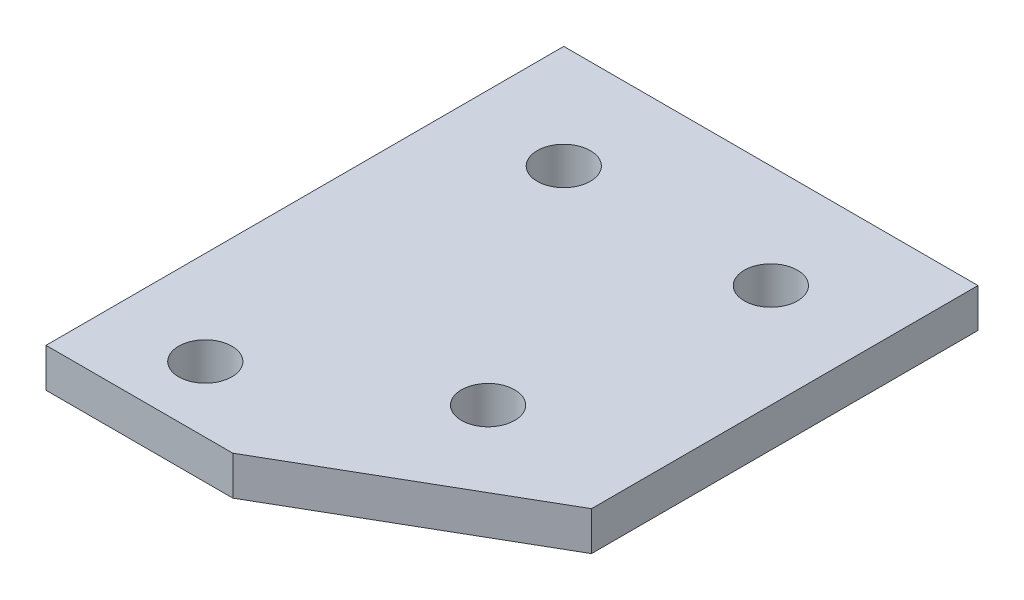
ISO-10303-21;
HEADER;
FILE_DESCRIPTION(('STEP AP214'),'2;1');
FILE_NAME('part.step','',(''),(''),'','','');
FILE_SCHEMA(('AUTOMOTIVE_DESIGN { 1 0 10303 214 1 1 1 1 }'));
ENDSEC;
DATA;
#1=APPLICATION_CONTEXT('core data for automotive mechanical design processes');
#2=APPLICATION_PROTOCOL_DEFINITION('international standard','automotive_design',2000,#1);
#3=PRODUCT_CONTEXT('',#1,'mechanical');
#4=PRODUCT('Part','Part','',(#3));
#5=PRODUCT_RELATED_PRODUCT_CATEGORY('part','',(#4));
#6=PRODUCT_DEFINITION_FORMATION('','',#4);
#7=PRODUCT_DEFINITION_CONTEXT('part definition',#1,'design');
#8=PRODUCT_DEFINITION('design','',#6,#7);
#9=PRODUCT_DEFINITION_SHAPE('','',#8);
#10=(LENGTH_UNIT() NAMED_UNIT(*) SI_UNIT(.MILLI.,.METRE.));
#11=(NAMED_UNIT(*) PLANE_ANGLE_UNIT() SI_UNIT($,.RADIAN.));
#12=(NAMED_UNIT(*) SI_UNIT($,.STERADIAN.) SOLID_ANGLE_UNIT());
#13=UNCERTAINTY_MEASURE_WITH_UNIT(LENGTH_MEASURE(1.E-05),#10,'distance_accuracy_value','');
#14=(GEOMETRIC_REPRESENTATION_CONTEXT(3) GLOBAL_UNCERTAINTY_ASSIGNED_CONTEXT((#13)) GLOBAL_UNIT_ASSIGNED_CONTEXT((#10,
#11,#12)) REPRESENTATION_CONTEXT('',''));
#15=CARTESIAN_POINT('',(0.,0.,0.));
#16=DIRECTION('',(0.,0.,1.));
#17=DIRECTION('',(1.,0.,0.));
#18=AXIS2_PLACEMENT_3D('',#15,#16,#17);
#19=CARTESIAN_POINT('',(22.9077466152338,-4.7752,63.5));
#20=DIRECTION('',(0.499999999999999,0.,0.866025403784439));
#21=DIRECTION('',(0.866025403784439,0.,-0.5));
#22=AXIS2_PLACEMENT_3D('',#19,#20,#21);
#23=PLANE('',#22);
#24=DIRECTION('',(0.866025403784439,0.,-0.5));
#25=VECTOR('',#24,1.);
#26=CARTESIAN_POINT('',(22.9077466152338,0.,63.5));
#27=LINE('',#26,#25);
#28=CARTESIAN_POINT('',(22.9077466152338,0.,63.5));
#29=VERTEX_POINT('',#28);
#30=CARTESIAN_POINT('',(50.8,0.,47.3964));
#31=VERTEX_POINT('',#30);
#32=EDGE_CURVE('E109',#29,#31,#27,.T.);
#33=ORIENTED_EDGE('',*,*,#32,.F.);
#34=DIRECTION('',(0.,1.,0.));
#35=VECTOR('',#34,1.);
#36=CARTESIAN_POINT('',(22.9077466152338,-4.7752,63.5));
#37=LINE('',#36,#35);
#38=CARTESIAN_POINT('',(22.9077466152338,-4.7752,63.5));
#39=VERTEX_POINT('',#38);
#40=EDGE_CURVE('E11',#39,#29,#37,.T.);
#41=ORIENTED_EDGE('',*,*,#40,.F.);
#42=DIRECTION('',(0.866025403784439,0.,-0.5));
#43=VECTOR('',#42,1.);
#44=CARTESIAN_POINT('',(22.9077466152338,-4.7752,63.5));
#45=LINE('',#44,#43);
#46=CARTESIAN_POINT('',(50.8,-4.7752,47.3964));
#47=VERTEX_POINT('',#46);
#48=EDGE_CURVE('E104',#39,#47,#45,.T.);
#49=ORIENTED_EDGE('',*,*,#48,.T.);
#50=DIRECTION('',(0.,1.,0.));
#51=VECTOR('',#50,1.);
#52=CARTESIAN_POINT('',(50.8,-4.7752,47.3964));
#53=LINE('',#52,#51);
#54=EDGE_CURVE('E35',#47,#31,#53,.T.);
#55=ORIENTED_EDGE('',*,*,#54,.T.);
#56=EDGE_LOOP('',(#33,#41,#49,#55));
#57=FACE_BOUND('',#56,.T.);
#58=ADVANCED_FACE('F32',(#57),#23,.T.);
#59=CARTESIAN_POINT('',(0.,-4.7752,63.5));
#60=DIRECTION('',(0.,0.,1.));
#61=DIRECTION('',(1.,0.,0.));
#62=AXIS2_PLACEMENT_3D('',#59,#60,#61);
#63=PLANE('',#62);
#64=DIRECTION('',(1.,0.,0.));
#65=VECTOR('',#64,1.);
#66=CARTESIAN_POINT('',(0.,0.,63.5));
#67=LINE('',#66,#65);
#68=CARTESIAN_POINT('',(0.,0.,63.5));
#69=VERTEX_POINT('',#68);
#70=EDGE_CURVE('E119',#69,#29,#67,.T.);
#71=ORIENTED_EDGE('',*,*,#70,.F.);
#72=DIRECTION('',(0.,1.,0.));
#73=VECTOR('',#72,1.);
#74=CARTESIAN_POINT('',(0.,-4.7752,63.5));
#75=LINE('',#74,#73);
#76=CARTESIAN_POINT('',(0.,-4.7752,63.5));
#77=VERTEX_POINT('',#76);
#78=EDGE_CURVE('E41',#77,#69,#75,.T.);
#79=ORIENTED_EDGE('',*,*,#78,.F.);
#80=DIRECTION('',(1.,0.,0.));
#81=VECTOR('',#80,1.);
#82=CARTESIAN_POINT('',(0.,-4.7752,63.5));
#83=LINE('',#82,#81);
#84=EDGE_CURVE('E99',#77,#39,#83,.T.);
#85=ORIENTED_EDGE('',*,*,#84,.T.);
#86=ORIENTED_EDGE('',*,*,#40,.T.);
#87=EDGE_LOOP('',(#71,#79,#85,#86));
#88=FACE_BOUND('',#87,.T.);
#89=ADVANCED_FACE('F125',(#88),#63,.T.);
#90=CARTESIAN_POINT('',(0.,-4.7752,0.));
#91=DIRECTION('',(-1.,0.,0.));
#92=DIRECTION('',(0.,0.,1.));
#93=AXIS2_PLACEMENT_3D('',#90,#91,#92);
#94=PLANE('',#93);
#95=DIRECTION('',(0.,0.,1.));
#96=VECTOR('',#95,1.);
#97=CARTESIAN_POINT('',(0.,0.,0.));
#98=LINE('',#97,#96);
#99=CARTESIAN_POINT('',(0.,0.,0.));
#100=VERTEX_POINT('',#99);
#101=EDGE_CURVE('E88',#100,#69,#98,.T.);
#102=ORIENTED_EDGE('',*,*,#101,.F.);
#103=DIRECTION('',(0.,1.,0.));
#104=VECTOR('',#103,1.);
#105=CARTESIAN_POINT('',(0.,-4.7752,0.));
#106=LINE('',#105,#104);
#107=CARTESIAN_POINT('',(0.,-4.7752,0.));
#108=VERTEX_POINT('',#107);
#109=EDGE_CURVE('E83',#108,#100,#106,.T.);
#110=ORIENTED_EDGE('',*,*,#109,.F.);
#111=DIRECTION('',(0.,0.,1.));
#112=VECTOR('',#111,1.);
#113=CARTESIAN_POINT('',(0.,-4.7752,0.));
#114=LINE('',#113,#112);
#115=EDGE_CURVE('E86',#108,#77,#114,.T.);
#116=ORIENTED_EDGE('',*,*,#115,.T.);
#117=ORIENTED_EDGE('',*,*,#78,.T.);
#118=EDGE_LOOP('',(#102,#110,#116,#117));
#119=FACE_BOUND('',#118,.T.);
#120=ADVANCED_FACE('F85',(#119),#94,.T.);
#121=CARTESIAN_POINT('',(50.8,-4.7752,0.));
#122=DIRECTION('',(0.,0.,-1.));
#123=DIRECTION('',(-1.,0.,0.));
#124=AXIS2_PLACEMENT_3D('',#121,#122,#123);
#125=PLANE('',#124);
#126=DIRECTION('',(-1.,0.,0.));
#127=VECTOR('',#126,1.);
#128=CARTESIAN_POINT('',(50.8,0.,0.));
#129=LINE('',#128,#127);
#130=CARTESIAN_POINT('',(50.8,0.,0.));
#131=VERTEX_POINT('',#130);
#132=EDGE_CURVE('E116',#131,#100,#129,.T.);
#133=ORIENTED_EDGE('',*,*,#132,.F.);
#134=DIRECTION('',(0.,1.,0.));
#135=VECTOR('',#134,1.);
#136=CARTESIAN_POINT('',(50.8,-4.7752,0.));
#137=LINE('',#136,#135);
#138=CARTESIAN_POINT('',(50.8,-4.7752,0.));
#139=VERTEX_POINT('',#138);
#140=EDGE_CURVE('E93',#139,#131,#137,.T.);
#141=ORIENTED_EDGE('',*,*,#140,.F.);
#142=DIRECTION('',(-1.,0.,0.));
#143=VECTOR('',#142,1.);
#144=CARTESIAN_POINT('',(50.8,-4.7752,0.));
#145=LINE('',#144,#143);
#146=EDGE_CURVE('E98',#139,#108,#145,.T.);
#147=ORIENTED_EDGE('',*,*,#146,.T.);
#148=ORIENTED_EDGE('',*,*,#109,.T.);
#149=EDGE_LOOP('',(#133,#141,#147,#148));
#150=FACE_BOUND('',#149,.T.);
#151=ADVANCED_FACE('F101',(#150),#125,.T.);
#152=CARTESIAN_POINT('',(50.8,-4.7752,47.3964));
#153=DIRECTION('',(1.,0.,0.));
#154=DIRECTION('',(0.,0.,-1.));
#155=AXIS2_PLACEMENT_3D('',#152,#153,#154);
#156=PLANE('',#155);
#157=DIRECTION('',(0.,0.,-1.));
#158=VECTOR('',#157,1.);
#159=CARTESIAN_POINT('',(50.8,0.,47.3964));
#160=LINE('',#159,#158);
#161=EDGE_CURVE('E112',#31,#131,#160,.T.);
#162=ORIENTED_EDGE('',*,*,#161,.F.);
#163=ORIENTED_EDGE('',*,*,#54,.F.);
#164=DIRECTION('',(0.,0.,-1.));
#165=VECTOR('',#164,1.);
#166=CARTESIAN_POINT('',(50.8,-4.7752,47.3964));
#167=LINE('',#166,#165);
#168=EDGE_CURVE('E102',#47,#139,#167,.T.);
#169=ORIENTED_EDGE('',*,*,#168,.T.);
#170=ORIENTED_EDGE('',*,*,#140,.T.);
#171=EDGE_LOOP('',(#162,#163,#169,#170));
#172=FACE_BOUND('',#171,.T.);
#173=ADVANCED_FACE('F122',(#172),#156,.T.);
#174=CARTESIAN_POINT('',(0.,-4.7752,0.));
#175=DIRECTION('',(0.,1.,0.));
#176=DIRECTION('',(0.,0.,1.));
#177=AXIS2_PLACEMENT_3D('',#174,#175,#176);
#178=PLANE('',#177);
#179=CARTESIAN_POINT('',(12.7,-4.7752,12.7));
#180=DIRECTION('',(0.,1.,0.));
#181=DIRECTION('',(0.,0.,-1.));
#182=AXIS2_PLACEMENT_3D('',#179,#180,#181);
#183=CIRCLE('',#182,3.2639);
#184=CARTESIAN_POINT('',(12.7,-4.7752,9.4361));
#185=VERTEX_POINT('',#184);
#186=EDGE_CURVE('E168',#185,#185,#183,.T.);
#187=ORIENTED_EDGE('',*,*,#186,.T.);
#188=EDGE_LOOP('',(#187));
#189=FACE_BOUND('',#188,.T.);
#190=CARTESIAN_POINT('',(38.1,-4.7752,12.7));
#191=DIRECTION('',(0.,1.,0.));
#192=DIRECTION('',(0.,0.,-1.));
#193=AXIS2_PLACEMENT_3D('',#190,#191,#192);
#194=CIRCLE('',#193,3.2639);
#195=CARTESIAN_POINT('',(38.1,-4.7752,9.4361));
#196=VERTEX_POINT('',#195);
#197=EDGE_CURVE('E176',#196,#196,#194,.T.);
#198=ORIENTED_EDGE('',*,*,#197,.T.);
#199=EDGE_LOOP('',(#198));
#200=FACE_BOUND('',#199,.T.);
#201=CARTESIAN_POINT('',(33.45942,-4.7752,42.74312));
#202=DIRECTION('',(0.,1.,0.));
#203=DIRECTION('',(0.,0.,-1.));
#204=AXIS2_PLACEMENT_3D('',#201,#202,#203);
#205=CIRCLE('',#204,3.26389999999999);
#206=CARTESIAN_POINT('',(33.45942,-4.7752,39.47922));
#207=VERTEX_POINT('',#206);
#208=EDGE_CURVE('E182',#207,#207,#205,.T.);
#209=ORIENTED_EDGE('',*,*,#208,.T.);
#210=EDGE_LOOP('',(#209));
#211=FACE_BOUND('',#210,.T.);
#212=CARTESIAN_POINT('',(11.48588,-4.7752,55.45328));
#213=DIRECTION('',(0.,1.,0.));
#214=DIRECTION('',(0.,0.,-1.));
#215=AXIS2_PLACEMENT_3D('',#212,#213,#214);
#216=CIRCLE('',#215,3.2639);
#217=CARTESIAN_POINT('',(11.48588,-4.7752,52.18938));
#218=VERTEX_POINT('',#217);
#219=EDGE_CURVE('E113',#218,#218,#216,.T.);
#220=ORIENTED_EDGE('',*,*,#219,.T.);
#221=EDGE_LOOP('',(#220));
#222=FACE_BOUND('',#221,.T.);
#223=ORIENTED_EDGE('',*,*,#48,.F.);
#224=ORIENTED_EDGE('',*,*,#84,.F.);
#225=ORIENTED_EDGE('',*,*,#115,.F.);
#226=ORIENTED_EDGE('',*,*,#146,.F.);
#227=ORIENTED_EDGE('',*,*,#168,.F.);
#228=EDGE_LOOP('',(#223,#224,#225,#226,#227));
#229=FACE_BOUND('',#228,.T.);
#230=ADVANCED_FACE('F97',(#189,#200,#211,#222,#229),#178,.F.);
#231=CARTESIAN_POINT('',(0.,0.,0.));
#232=DIRECTION('',(0.,1.,0.));
#233=DIRECTION('',(0.,0.,1.));
#234=AXIS2_PLACEMENT_3D('',#231,#232,#233);
#235=PLANE('',#234);
#236=CARTESIAN_POINT('',(12.7,0.,12.7));
#237=DIRECTION('',(0.,1.,0.));
#238=DIRECTION('',(0.,0.,-1.));
#239=AXIS2_PLACEMENT_3D('',#236,#237,#238);
#240=CIRCLE('',#239,3.2639);
#241=CARTESIAN_POINT('',(12.7,0.,9.4361));
#242=VERTEX_POINT('',#241);
#243=EDGE_CURVE('E171',#242,#242,#240,.T.);
#244=ORIENTED_EDGE('',*,*,#243,.F.);
#245=EDGE_LOOP('',(#244));
#246=FACE_BOUND('',#245,.T.);
#247=CARTESIAN_POINT('',(38.1,0.,12.7));
#248=DIRECTION('',(0.,1.,0.));
#249=DIRECTION('',(0.,0.,-1.));
#250=AXIS2_PLACEMENT_3D('',#247,#248,#249);
#251=CIRCLE('',#250,3.2639);
#252=CARTESIAN_POINT('',(38.1,0.,9.4361));
#253=VERTEX_POINT('',#252);
#254=EDGE_CURVE('E173',#253,#253,#251,.T.);
#255=ORIENTED_EDGE('',*,*,#254,.F.);
#256=EDGE_LOOP('',(#255));
#257=FACE_BOUND('',#256,.T.);
#258=CARTESIAN_POINT('',(33.45942,0.,42.74312));
#259=DIRECTION('',(0.,1.,0.));
#260=DIRECTION('',(0.,0.,-1.));
#261=AXIS2_PLACEMENT_3D('',#258,#259,#260);
#262=CIRCLE('',#261,3.26389999999999);
#263=CARTESIAN_POINT('',(33.45942,0.,39.47922));
#264=VERTEX_POINT('',#263);
#265=EDGE_CURVE('E179',#264,#264,#262,.T.);
#266=ORIENTED_EDGE('',*,*,#265,.F.);
#267=EDGE_LOOP('',(#266));
#268=FACE_BOUND('',#267,.T.);
#269=CARTESIAN_POINT('',(11.48588,0.,55.45328));
#270=DIRECTION('',(0.,1.,0.));
#271=DIRECTION('',(0.,0.,-1.));
#272=AXIS2_PLACEMENT_3D('',#269,#270,#271);
#273=CIRCLE('',#272,3.2639);
#274=CARTESIAN_POINT('',(11.48588,0.,52.18938));
#275=VERTEX_POINT('',#274);
#276=EDGE_CURVE('E185',#275,#275,#273,.T.);
#277=ORIENTED_EDGE('',*,*,#276,.F.);
#278=EDGE_LOOP('',(#277));
#279=FACE_BOUND('',#278,.T.);
#280=ORIENTED_EDGE('',*,*,#32,.T.);
#281=ORIENTED_EDGE('',*,*,#161,.T.);
#282=ORIENTED_EDGE('',*,*,#132,.T.);
#283=ORIENTED_EDGE('',*,*,#101,.T.);
#284=ORIENTED_EDGE('',*,*,#70,.T.);
#285=EDGE_LOOP('',(#280,#281,#282,#283,#284));
#286=FACE_BOUND('',#285,.T.);
#287=ADVANCED_FACE('F124',(#246,#257,#268,#279,#286),#235,.T.);
#288=CARTESIAN_POINT('',(11.48588,-4.7752,55.45328));
#289=DIRECTION('',(0.,1.,0.));
#290=DIRECTION('',(0.,0.,1.));
#291=AXIS2_PLACEMENT_3D('',#288,#289,#290);
#292=CYLINDRICAL_SURFACE('',#291,3.2639);
#293=ORIENTED_EDGE('',*,*,#219,.F.);
#294=EDGE_LOOP('',(#293));
#295=FACE_BOUND('',#294,.T.);
#296=ORIENTED_EDGE('',*,*,#276,.T.);
#297=EDGE_LOOP('',(#296));
#298=FACE_BOUND('',#297,.T.);
#299=ADVANCED_FACE('F145',(#295,#298),#292,.F.);
#300=CARTESIAN_POINT('',(33.45942,-4.7752,42.74312));
#301=DIRECTION('',(0.,1.,0.));
#302=DIRECTION('',(0.,0.,1.));
#303=AXIS2_PLACEMENT_3D('',#300,#301,#302);
#304=CYLINDRICAL_SURFACE('',#303,3.26389999999999);
#305=ORIENTED_EDGE('',*,*,#208,.F.);
#306=EDGE_LOOP('',(#305));
#307=FACE_BOUND('',#306,.T.);
#308=ORIENTED_EDGE('',*,*,#265,.T.);
#309=EDGE_LOOP('',(#308));
#310=FACE_BOUND('',#309,.T.);
#311=ADVANCED_FACE('F152',(#307,#310),#304,.F.);
#312=CARTESIAN_POINT('',(38.1,-4.7752,12.7));
#313=DIRECTION('',(0.,1.,0.));
#314=DIRECTION('',(0.,0.,1.));
#315=AXIS2_PLACEMENT_3D('',#312,#313,#314);
#316=CYLINDRICAL_SURFACE('',#315,3.2639);
#317=ORIENTED_EDGE('',*,*,#197,.F.);
#318=EDGE_LOOP('',(#317));
#319=FACE_BOUND('',#318,.T.);
#320=ORIENTED_EDGE('',*,*,#254,.T.);
#321=EDGE_LOOP('',(#320));
#322=FACE_BOUND('',#321,.T.);
#323=ADVANCED_FACE('F156',(#319,#322),#316,.F.);
#324=CARTESIAN_POINT('',(12.7,-4.7752,12.7));
#325=DIRECTION('',(0.,1.,0.));
#326=DIRECTION('',(0.,0.,1.));
#327=AXIS2_PLACEMENT_3D('',#324,#325,#326);
#328=CYLINDRICAL_SURFACE('',#327,3.2639);
#329=ORIENTED_EDGE('',*,*,#186,.F.);
#330=EDGE_LOOP('',(#329));
#331=FACE_BOUND('',#330,.T.);
#332=ORIENTED_EDGE('',*,*,#243,.T.);
#333=EDGE_LOOP('',(#332));
#334=FACE_BOUND('',#333,.T.);
#335=ADVANCED_FACE('F160',(#331,#334),#328,.F.);
#336=CLOSED_SHELL('',(#58,#89,#120,#151,#173,#230,#287,#299,#311,#323,#335));
#337=MANIFOLD_SOLID_BREP('B2',#336);
#338=ADVANCED_BREP_SHAPE_REPRESENTATION('',(#18,#337),#14);
#339=SHAPE_DEFINITION_REPRESENTATION(#9,#338);
ENDSEC;
END-ISO-10303-21;
